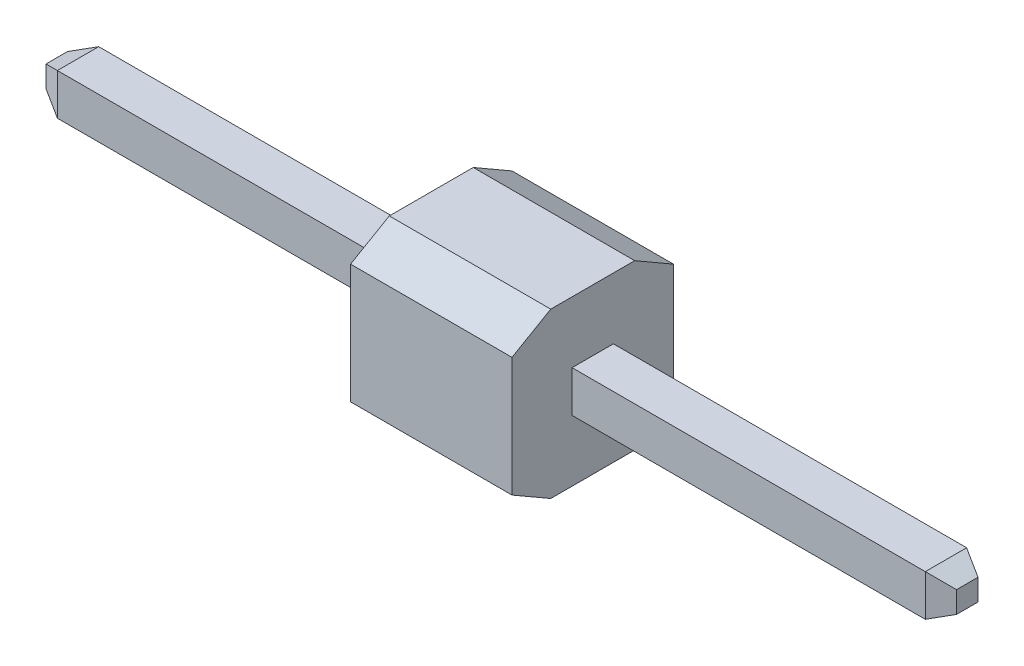
ISO-10303-21;
HEADER;
FILE_DESCRIPTION(('STEP AP214'),'2;1');
FILE_NAME('part.step','',(''),(''),'','','');
FILE_SCHEMA(('AUTOMOTIVE_DESIGN { 1 0 10303 214 1 1 1 1 }'));
ENDSEC;
DATA;
#1=APPLICATION_CONTEXT('core data for automotive mechanical design processes');
#2=APPLICATION_PROTOCOL_DEFINITION('international standard','automotive_design',2000,#1);
#3=PRODUCT_CONTEXT('',#1,'mechanical');
#4=PRODUCT('Part','Part','',(#3));
#5=PRODUCT_RELATED_PRODUCT_CATEGORY('part','',(#4));
#6=PRODUCT_DEFINITION_FORMATION('','',#4);
#7=PRODUCT_DEFINITION_CONTEXT('part definition',#1,'design');
#8=PRODUCT_DEFINITION('design','',#6,#7);
#9=PRODUCT_DEFINITION_SHAPE('','',#8);
#10=(LENGTH_UNIT() NAMED_UNIT(*) SI_UNIT(.MILLI.,.METRE.));
#11=(NAMED_UNIT(*) PLANE_ANGLE_UNIT() SI_UNIT($,.RADIAN.));
#12=(NAMED_UNIT(*) SI_UNIT($,.STERADIAN.) SOLID_ANGLE_UNIT());
#13=UNCERTAINTY_MEASURE_WITH_UNIT(LENGTH_MEASURE(1.E-05),#10,'distance_accuracy_value','');
#14=(GEOMETRIC_REPRESENTATION_CONTEXT(3) GLOBAL_UNCERTAINTY_ASSIGNED_CONTEXT((#13)) GLOBAL_UNIT_ASSIGNED_CONTEXT((#10,
#11,#12)) REPRESENTATION_CONTEXT('',''));
#15=CARTESIAN_POINT('',(0.,0.,0.));
#16=DIRECTION('',(0.,0.,1.));
#17=DIRECTION('',(1.,0.,0.));
#18=AXIS2_PLACEMENT_3D('',#15,#16,#17);
#19=CARTESIAN_POINT('',(5.42107527862679,-7.9371215871937,0.629998634255617));
#20=DIRECTION('',(1.,4.37113882867379E-08,-4.37113882867379E-08));
#21=DIRECTION('',(-4.37113882867379E-08,1.,0.));
#22=AXIS2_PLACEMENT_3D('',#19,#20,#21);
#23=PLANE('',#22);
#24=DIRECTION('',(1.59994777304463E-08,0.50000000000019,0.866025403784329));
#25=VECTOR('',#24,1.);
#26=CARTESIAN_POINT('',(5.42107515564087,-6.6935317487037,-0.940001365744382));
#27=LINE('',#26,#25);
#28=CARTESIAN_POINT('',(5.42107515564087,-6.6935317487037,-0.940001365744382));
#29=VERTEX_POINT('',#28);
#30=CARTESIAN_POINT('',(5.42107516672563,-6.3471215871937,-0.340001365744383));
#31=VERTEX_POINT('',#30);
#32=EDGE_CURVE('E11',#29,#31,#27,.T.);
#33=ORIENTED_EDGE('',*,*,#32,.T.);
#34=DIRECTION('',(4.37113886966664E-08,0.,0.999999999999999));
#35=VECTOR('',#34,1.);
#36=CARTESIAN_POINT('',(5.42107516672563,-6.3471215871937,-0.340001365744383));
#37=LINE('',#36,#35);
#38=CARTESIAN_POINT('',(5.42107522355044,-6.3471215871937,0.959998634255618));
#39=VERTEX_POINT('',#38);
#40=EDGE_CURVE('E304',#31,#39,#37,.T.);
#41=ORIENTED_EDGE('',*,*,#40,.T.);
#42=DIRECTION('',(5.97108668825761E-08,-0.500000000000186,0.86602540378433));
#43=VECTOR('',#42,1.);
#44=CARTESIAN_POINT('',(5.42107522355044,-6.3471215871937,0.959998634255618));
#45=LINE('',#44,#43);
#46=CARTESIAN_POINT('',(5.42107526491934,-6.69353174870369,1.55999863425562));
#47=VERTEX_POINT('',#46);
#48=EDGE_CURVE('E296',#39,#47,#45,.T.);
#49=ORIENTED_EDGE('',*,*,#48,.T.);
#50=DIRECTION('',(4.37113884815544E-08,-0.999999999999999,0.));
#51=VECTOR('',#50,1.);
#52=CARTESIAN_POINT('',(5.42107526491934,-6.69353174870369,1.55999863425562));
#53=LINE('',#52,#51);
#54=CARTESIAN_POINT('',(5.42107534566213,-8.5407114256737,1.55999863425562));
#55=VERTEX_POINT('',#54);
#56=EDGE_CURVE('E281',#47,#55,#53,.T.);
#57=ORIENTED_EDGE('',*,*,#56,.T.);
#58=DIRECTION('',(1.5999479012306E-08,0.500000000000192,0.866025403784328));
#59=VECTOR('',#58,1.);
#60=CARTESIAN_POINT('',(5.42107533457736,-8.8871215871937,0.959998634255618));
#61=LINE('',#60,#59);
#62=CARTESIAN_POINT('',(5.42107533457736,-8.8871215871937,0.959998634255618));
#63=VERTEX_POINT('',#62);
#64=EDGE_CURVE('E265',#63,#55,#61,.T.);
#65=ORIENTED_EDGE('',*,*,#64,.F.);
#66=DIRECTION('',(4.37113886966664E-08,0.,0.999999999999999));
#67=VECTOR('',#66,1.);
#68=CARTESIAN_POINT('',(5.42107527775256,-8.8871215871937,-0.340001365744383));
#69=LINE('',#68,#67);
#70=CARTESIAN_POINT('',(5.42107527775256,-8.8871215871937,-0.340001365744383));
#71=VERTEX_POINT('',#70);
#72=EDGE_CURVE('E248',#71,#63,#69,.T.);
#73=ORIENTED_EDGE('',*,*,#72,.F.);
#74=DIRECTION('',(5.97108656001701E-08,-0.500000000000187,0.866025403784328));
#75=VECTOR('',#74,1.);
#76=CARTESIAN_POINT('',(5.42107523638366,-8.5407114256737,-0.940001365744382));
#77=LINE('',#76,#75);
#78=CARTESIAN_POINT('',(5.42107523638366,-8.5407114256737,-0.940001365744382));
#79=VERTEX_POINT('',#78);
#80=EDGE_CURVE('E242',#79,#71,#77,.T.);
#81=ORIENTED_EDGE('',*,*,#80,.F.);
#82=DIRECTION('',(4.37113884815544E-08,-0.999999999999999,0.));
#83=VECTOR('',#82,1.);
#84=CARTESIAN_POINT('',(5.42107515564087,-6.6935317487037,-0.940001365744382));
#85=LINE('',#84,#83);
#86=EDGE_CURVE('E236',#29,#79,#85,.T.);
#87=ORIENTED_EDGE('',*,*,#86,.F.);
#88=EDGE_LOOP('',(#33,#41,#49,#57,#65,#73,#81,#87));
#89=FACE_BOUND('',#88,.T.);
#90=DIRECTION('',(-4.37113872875372E-08,0.,-0.999999999999999));
#91=VECTOR('',#90,1.);
#92=CARTESIAN_POINT('',(5.4210752506515,-7.2971215871937,0.629998634255617));
#93=LINE('',#92,#91);
#94=CARTESIAN_POINT('',(5.4210752506515,-7.2971215871937,0.629998634255617));
#95=VERTEX_POINT('',#94);
#96=CARTESIAN_POINT('',(5.42107522267621,-7.2971215871937,-0.0100013657443826));
#97=VERTEX_POINT('',#96);
#98=EDGE_CURVE('E302',#95,#97,#93,.T.);
#99=ORIENTED_EDGE('',*,*,#98,.T.);
#100=DIRECTION('',(-4.37113872875371E-08,0.999999999999999,0.));
#101=VECTOR('',#100,1.);
#102=CARTESIAN_POINT('',(5.4210752506515,-7.9371215871937,-0.0100013657443826));
#103=LINE('',#102,#101);
#104=CARTESIAN_POINT('',(5.4210752506515,-7.9371215871937,-0.0100013657443826));
#105=VERTEX_POINT('',#104);
#106=EDGE_CURVE('E293',#105,#97,#103,.T.);
#107=ORIENTED_EDGE('',*,*,#106,.F.);
#108=DIRECTION('',(-4.37113900630947E-08,0.,-0.999999999999999));
#109=VECTOR('',#108,1.);
#110=CARTESIAN_POINT('',(5.42107527862679,-7.9371215871937,0.629998634255617));
#111=LINE('',#110,#109);
#112=CARTESIAN_POINT('',(5.42107527862679,-7.9371215871937,0.629998634255617));
#113=VERTEX_POINT('',#112);
#114=EDGE_CURVE('E278',#113,#105,#111,.T.);
#115=ORIENTED_EDGE('',*,*,#114,.F.);
#116=DIRECTION('',(-4.37113900630947E-08,0.999999999999999,0.));
#117=VECTOR('',#116,1.);
#118=CARTESIAN_POINT('',(5.42107527862679,-7.9371215871937,0.629998634255617));
#119=LINE('',#118,#117);
#120=EDGE_CURVE('E263',#113,#95,#119,.T.);
#121=ORIENTED_EDGE('',*,*,#120,.T.);
#122=EDGE_LOOP('',(#99,#107,#115,#121));
#123=FACE_BOUND('',#122,.T.);
#124=ADVANCED_FACE('F17',(#89,#123),#23,.T.);
#125=CARTESIAN_POINT('',(2.92107527862679,-7.93712169647217,0.629998743534088));
#126=DIRECTION('',(1.,4.37113882867379E-08,-4.37113882867379E-08));
#127=DIRECTION('',(-4.37113882867379E-08,1.,0.));
#128=AXIS2_PLACEMENT_3D('',#125,#126,#127);
#129=PLANE('',#128);
#130=DIRECTION('',(1.59994783714339E-08,0.50000000000019,0.866025403784329));
#131=VECTOR('',#130,1.);
#132=CARTESIAN_POINT('',(2.92107515564087,-6.69353185798217,-0.940001256465912));
#133=LINE('',#132,#131);
#134=CARTESIAN_POINT('',(2.92107515564087,-6.69353185798217,-0.940001256465912));
#135=VERTEX_POINT('',#134);
#136=CARTESIAN_POINT('',(2.92107516672563,-6.34712169647217,-0.340001256465912));
#137=VERTEX_POINT('',#136);
#138=EDGE_CURVE('E24',#135,#137,#133,.T.);
#139=ORIENTED_EDGE('',*,*,#138,.F.);
#140=DIRECTION('',(4.37113882411396E-08,-0.999999999999999,0.));
#141=VECTOR('',#140,1.);
#142=CARTESIAN_POINT('',(2.92107515564087,-6.69353185798217,-0.940001256465912));
#143=LINE('',#142,#141);
#144=CARTESIAN_POINT('',(2.92107523638366,-8.54071153495217,-0.940001256465912));
#145=VERTEX_POINT('',#144);
#146=EDGE_CURVE('E300',#135,#145,#143,.T.);
#147=ORIENTED_EDGE('',*,*,#146,.T.);
#148=DIRECTION('',(5.97108668821452E-08,-0.500000000000187,0.866025403784328));
#149=VECTOR('',#148,1.);
#150=CARTESIAN_POINT('',(2.92107523638366,-8.54071153495217,-0.940001256465912));
#151=LINE('',#150,#149);
#152=CARTESIAN_POINT('',(2.92107527775256,-8.88712169647217,-0.340001256465912));
#153=VERTEX_POINT('',#152);
#154=EDGE_CURVE('E286',#145,#153,#151,.T.);
#155=ORIENTED_EDGE('',*,*,#154,.T.);
#156=DIRECTION('',(4.37113883550593E-08,0.,0.999999999999999));
#157=VECTOR('',#156,1.);
#158=CARTESIAN_POINT('',(2.92107527775256,-8.88712169647217,-0.340001256465912));
#159=LINE('',#158,#157);
#160=CARTESIAN_POINT('',(2.92107533457736,-8.88712169647217,0.959998743534088));
#161=VERTEX_POINT('',#160);
#162=EDGE_CURVE('E271',#153,#161,#159,.T.);
#163=ORIENTED_EDGE('',*,*,#162,.T.);
#164=DIRECTION('',(1.59994783713184E-08,0.500000000000192,0.866025403784328));
#165=VECTOR('',#164,1.);
#166=CARTESIAN_POINT('',(2.92107533457736,-8.88712169647217,0.959998743534088));
#167=LINE('',#166,#165);
#168=CARTESIAN_POINT('',(2.92107534566213,-8.54071153495217,1.55999874353409));
#169=VERTEX_POINT('',#168);
#170=EDGE_CURVE('E253',#161,#169,#167,.T.);
#171=ORIENTED_EDGE('',*,*,#170,.T.);
#172=DIRECTION('',(4.37113882411396E-08,-0.999999999999999,0.));
#173=VECTOR('',#172,1.);
#174=CARTESIAN_POINT('',(2.92107526491934,-6.69353185798217,1.55999874353409));
#175=LINE('',#174,#173);
#176=CARTESIAN_POINT('',(2.92107526491934,-6.69353185798217,1.55999874353409));
#177=VERTEX_POINT('',#176);
#178=EDGE_CURVE('E261',#177,#169,#175,.T.);
#179=ORIENTED_EDGE('',*,*,#178,.F.);
#180=DIRECTION('',(5.97108668825761E-08,-0.500000000000186,0.86602540378433));
#181=VECTOR('',#180,1.);
#182=CARTESIAN_POINT('',(2.92107522355044,-6.34712169647217,0.959998743534088));
#183=LINE('',#182,#181);
#184=CARTESIAN_POINT('',(2.92107522355044,-6.34712169647217,0.959998743534088));
#185=VERTEX_POINT('',#184);
#186=EDGE_CURVE('E276',#185,#177,#183,.T.);
#187=ORIENTED_EDGE('',*,*,#186,.F.);
#188=DIRECTION('',(4.37113883550593E-08,0.,0.999999999999999));
#189=VECTOR('',#188,1.);
#190=CARTESIAN_POINT('',(2.92107516672563,-6.34712169647217,-0.340001256465912));
#191=LINE('',#190,#189);
#192=EDGE_CURVE('E291',#137,#185,#191,.T.);
#193=ORIENTED_EDGE('',*,*,#192,.F.);
#194=EDGE_LOOP('',(#139,#147,#155,#163,#171,#179,#187,#193));
#195=FACE_BOUND('',#194,.T.);
#196=DIRECTION('',(-4.37113879814265E-08,0.999999999999999,0.));
#197=VECTOR('',#196,1.);
#198=CARTESIAN_POINT('',(2.9210752506515,-7.93712169647217,-0.0100012564659119));
#199=LINE('',#198,#197);
#200=CARTESIAN_POINT('',(2.9210752506515,-7.93712169647217,-0.0100012564659119));
#201=VERTEX_POINT('',#200);
#202=CARTESIAN_POINT('',(2.92107522267621,-7.29712169647217,-0.0100012564659119));
#203=VERTEX_POINT('',#202);
#204=EDGE_CURVE('E298',#201,#203,#199,.T.);
#205=ORIENTED_EDGE('',*,*,#204,.T.);
#206=DIRECTION('',(-4.37113879814266E-08,0.,-0.999999999999999));
#207=VECTOR('',#206,1.);
#208=CARTESIAN_POINT('',(2.9210752506515,-7.29712169647217,0.629998743534088));
#209=LINE('',#208,#207);
#210=CARTESIAN_POINT('',(2.9210752506515,-7.29712169647217,0.629998743534088));
#211=VERTEX_POINT('',#210);
#212=EDGE_CURVE('E283',#211,#203,#209,.T.);
#213=ORIENTED_EDGE('',*,*,#212,.F.);
#214=DIRECTION('',(-4.37113886753159E-08,0.999999999999999,0.));
#215=VECTOR('',#214,1.);
#216=CARTESIAN_POINT('',(2.92107527862679,-7.93712169647217,0.629998743534088));
#217=LINE('',#216,#215);
#218=CARTESIAN_POINT('',(2.92107527862679,-7.93712169647217,0.629998743534088));
#219=VERTEX_POINT('',#218);
#220=EDGE_CURVE('E268',#219,#211,#217,.T.);
#221=ORIENTED_EDGE('',*,*,#220,.F.);
#222=DIRECTION('',(-4.37113886753159E-08,0.,-0.999999999999999));
#223=VECTOR('',#222,1.);
#224=CARTESIAN_POINT('',(2.92107527862679,-7.93712169647217,0.629998743534088));
#225=LINE('',#224,#223);
#226=EDGE_CURVE('E251',#219,#201,#225,.T.);
#227=ORIENTED_EDGE('',*,*,#226,.T.);
#228=EDGE_LOOP('',(#205,#213,#221,#227));
#229=FACE_BOUND('',#228,.T.);
#230=ADVANCED_FACE('F314',(#195,#229),#129,.F.);
#231=CARTESIAN_POINT('',(5.42107515564087,-6.6935317487037,-0.940001365744382));
#232=DIRECTION('',(5.97108668343731E-08,-0.866025403784328,0.50000000000019));
#233=DIRECTION('',(-1.59994785476185E-08,-0.500000000000192,-0.866025403784329));
#234=AXIS2_PLACEMENT_3D('',#231,#232,#233);
#235=PLANE('',#234);
#236=ORIENTED_EDGE('',*,*,#138,.T.);
#237=DIRECTION('',(-0.999999999999998,-4.37113897078233E-08,4.37113883755557E-08));
#238=VECTOR('',#237,1.);
#239=CARTESIAN_POINT('',(5.42107516672563,-6.3471215871937,-0.340001365744383));
#240=LINE('',#239,#238);
#241=EDGE_CURVE('E288',#31,#137,#240,.T.);
#242=ORIENTED_EDGE('',*,*,#241,.F.);
#243=ORIENTED_EDGE('',*,*,#32,.F.);
#244=DIRECTION('',(-0.999999999999998,-4.37113868656524E-08,4.37113881091022E-08));
#245=VECTOR('',#244,1.);
#246=CARTESIAN_POINT('',(5.42107515564087,-6.6935317487037,-0.940001365744382));
#247=LINE('',#246,#245);
#248=EDGE_CURVE('E256',#29,#135,#247,.T.);
#249=ORIENTED_EDGE('',*,*,#248,.T.);
#250=EDGE_LOOP('',(#236,#242,#243,#249));
#251=FACE_BOUND('',#250,.T.);
#252=ADVANCED_FACE('F306',(#251),#235,.F.);
#253=CARTESIAN_POINT('',(5.42107516672563,-6.3471215871937,-0.340001365744383));
#254=DIRECTION('',(4.37113882867379E-08,-1.,0.));
#255=DIRECTION('',(1.,4.37113882867379E-08,-4.37113882867379E-08));
#256=AXIS2_PLACEMENT_3D('',#253,#254,#255);
#257=PLANE('',#256);
#258=ORIENTED_EDGE('',*,*,#192,.T.);
#259=DIRECTION('',(-0.999999999999998,-4.37113897078233E-08,4.37113882867378E-08));
#260=VECTOR('',#259,1.);
#261=CARTESIAN_POINT('',(5.42107522355044,-6.3471215871937,0.959998634255618));
#262=LINE('',#261,#260);
#263=EDGE_CURVE('E273',#39,#185,#262,.T.);
#264=ORIENTED_EDGE('',*,*,#263,.F.);
#265=ORIENTED_EDGE('',*,*,#40,.F.);
#266=ORIENTED_EDGE('',*,*,#241,.T.);
#267=EDGE_LOOP('',(#258,#264,#265,#266));
#268=FACE_BOUND('',#267,.T.);
#269=ADVANCED_FACE('F311',(#268),#257,.F.);
#270=CARTESIAN_POINT('',(5.42107522355044,-6.3471215871937,0.959998634255618));
#271=DIRECTION('',(1.59994785476185E-08,-0.86602540378433,-0.50000000000019));
#272=DIRECTION('',(-5.97108668343731E-08,0.500000000000188,-0.866025403784329));
#273=AXIS2_PLACEMENT_3D('',#270,#271,#272);
#274=PLANE('',#273);
#275=ORIENTED_EDGE('',*,*,#186,.T.);
#276=DIRECTION('',(-0.999999999999998,-4.37113868656524E-08,4.37113882867378E-08));
#277=VECTOR('',#276,1.);
#278=CARTESIAN_POINT('',(5.42107526491934,-6.69353174870369,1.55999863425562));
#279=LINE('',#278,#277);
#280=EDGE_CURVE('E258',#47,#177,#279,.T.);
#281=ORIENTED_EDGE('',*,*,#280,.F.);
#282=ORIENTED_EDGE('',*,*,#48,.F.);
#283=ORIENTED_EDGE('',*,*,#263,.T.);
#284=EDGE_LOOP('',(#275,#281,#282,#283));
#285=FACE_BOUND('',#284,.T.);
#286=ADVANCED_FACE('F319',(#285),#274,.F.);
#287=CARTESIAN_POINT('',(5.42107526491934,-6.69353174870369,1.55999863425562));
#288=DIRECTION('',(-4.37113882867379E-08,0.,-1.));
#289=DIRECTION('',(-1.,-4.37113882867379E-08,4.37113882867379E-08));
#290=AXIS2_PLACEMENT_3D('',#287,#288,#289);
#291=PLANE('',#290);
#292=ORIENTED_EDGE('',*,*,#178,.T.);
#293=DIRECTION('',(-0.999999999999998,-4.37113868656524E-08,4.37113882867378E-08));
#294=VECTOR('',#293,1.);
#295=CARTESIAN_POINT('',(5.42107534566213,-8.5407114256737,1.55999863425562));
#296=LINE('',#295,#294);
#297=EDGE_CURVE('E245',#55,#169,#296,.T.);
#298=ORIENTED_EDGE('',*,*,#297,.F.);
#299=ORIENTED_EDGE('',*,*,#56,.F.);
#300=ORIENTED_EDGE('',*,*,#280,.T.);
#301=EDGE_LOOP('',(#292,#298,#299,#300));
#302=FACE_BOUND('',#301,.T.);
#303=ADVANCED_FACE('F326',(#302),#291,.F.);
#304=CARTESIAN_POINT('',(5.42107533457736,-8.8871215871937,0.959998634255618));
#305=DIRECTION('',(5.97108668343731E-08,-0.866025403784328,0.50000000000019));
#306=DIRECTION('',(-1.59994785476185E-08,-0.500000000000192,-0.866025403784329));
#307=AXIS2_PLACEMENT_3D('',#304,#305,#306);
#308=PLANE('',#307);
#309=ORIENTED_EDGE('',*,*,#170,.F.);
#310=DIRECTION('',(-0.999999999999998,-4.37113868656524E-08,4.37113882867378E-08));
#311=VECTOR('',#310,1.);
#312=CARTESIAN_POINT('',(5.42107533457736,-8.8871215871937,0.959998634255618));
#313=LINE('',#312,#311);
#314=EDGE_CURVE('E239',#63,#161,#313,.T.);
#315=ORIENTED_EDGE('',*,*,#314,.F.);
#316=ORIENTED_EDGE('',*,*,#64,.T.);
#317=ORIENTED_EDGE('',*,*,#297,.T.);
#318=EDGE_LOOP('',(#309,#315,#316,#317));
#319=FACE_BOUND('',#318,.T.);
#320=ADVANCED_FACE('F329',(#319),#308,.T.);
#321=CARTESIAN_POINT('',(5.42107527775256,-8.8871215871937,-0.340001365744383));
#322=DIRECTION('',(4.37113882867379E-08,-1.,0.));
#323=DIRECTION('',(1.,4.37113882867379E-08,-4.37113882867379E-08));
#324=AXIS2_PLACEMENT_3D('',#321,#322,#323);
#325=PLANE('',#324);
#326=ORIENTED_EDGE('',*,*,#162,.F.);
#327=DIRECTION('',(-0.999999999999998,-4.37113868656524E-08,4.37113883755557E-08));
#328=VECTOR('',#327,1.);
#329=CARTESIAN_POINT('',(5.42107527775256,-8.8871215871937,-0.340001365744383));
#330=LINE('',#329,#328);
#331=EDGE_CURVE('E233',#71,#153,#330,.T.);
#332=ORIENTED_EDGE('',*,*,#331,.F.);
#333=ORIENTED_EDGE('',*,*,#72,.T.);
#334=ORIENTED_EDGE('',*,*,#314,.T.);
#335=EDGE_LOOP('',(#326,#332,#333,#334));
#336=FACE_BOUND('',#335,.T.);
#337=ADVANCED_FACE('F333',(#336),#325,.T.);
#338=CARTESIAN_POINT('',(5.42107523638366,-8.5407114256737,-0.940001365744382));
#339=DIRECTION('',(1.59994785476185E-08,-0.86602540378433,-0.50000000000019));
#340=DIRECTION('',(-5.97108668343731E-08,0.500000000000188,-0.866025403784329));
#341=AXIS2_PLACEMENT_3D('',#338,#339,#340);
#342=PLANE('',#341);
#343=ORIENTED_EDGE('',*,*,#154,.F.);
#344=DIRECTION('',(-0.999999999999998,-4.37113868656524E-08,4.37113881091021E-08));
#345=VECTOR('',#344,1.);
#346=CARTESIAN_POINT('',(5.42107523638366,-8.5407114256737,-0.940001365744382));
#347=LINE('',#346,#345);
#348=EDGE_CURVE('E230',#79,#145,#347,.T.);
#349=ORIENTED_EDGE('',*,*,#348,.F.);
#350=ORIENTED_EDGE('',*,*,#80,.T.);
#351=ORIENTED_EDGE('',*,*,#331,.T.);
#352=EDGE_LOOP('',(#343,#349,#350,#351));
#353=FACE_BOUND('',#352,.T.);
#354=ADVANCED_FACE('F337',(#353),#342,.T.);
#355=CARTESIAN_POINT('',(5.42107515564087,-6.6935317487037,-0.940001365744382));
#356=DIRECTION('',(-4.37113882867379E-08,0.,-1.));
#357=DIRECTION('',(-4.37113882867379E-08,1.,0.));
#358=AXIS2_PLACEMENT_3D('',#355,#356,#357);
#359=PLANE('',#358);
#360=ORIENTED_EDGE('',*,*,#146,.F.);
#361=ORIENTED_EDGE('',*,*,#248,.F.);
#362=ORIENTED_EDGE('',*,*,#86,.T.);
#363=ORIENTED_EDGE('',*,*,#348,.T.);
#364=EDGE_LOOP('',(#360,#361,#362,#363));
#365=FACE_BOUND('',#364,.T.);
#366=ADVANCED_FACE('F339',(#365),#359,.T.);
#367=CARTESIAN_POINT('',(-2.87892472137321,-7.93712194999822,0.62999899706014));
#368=DIRECTION('',(-1.,-4.37113882867379E-08,4.37113882867379E-08));
#369=DIRECTION('',(4.37113882867379E-08,-1.,0.));
#370=AXIS2_PLACEMENT_3D('',#367,#368,#369);
#371=PLANE('',#370);
#372=DIRECTION('',(4.37113927490808E-08,-0.999999999999999,0.));
#373=VECTOR('',#372,1.);
#374=CARTESIAN_POINT('',(-2.87892476387104,-7.45100347718822,0.14388052425114));
#375=LINE('',#374,#373);
#376=CARTESIAN_POINT('',(-2.87892476387104,-7.45100347718822,0.14388052425114));
#377=VERTEX_POINT('',#376);
#378=CARTESIAN_POINT('',(-2.8789247493485,-7.78324042279822,0.14388052425114));
#379=VERTEX_POINT('',#378);
#380=EDGE_CURVE('E228',#377,#379,#375,.T.);
#381=ORIENTED_EDGE('',*,*,#380,.T.);
#382=DIRECTION('',(4.37113874013716E-08,0.,0.999999999999999));
#383=VECTOR('',#382,1.);
#384=CARTESIAN_POINT('',(-2.8789247493485,-7.78324042279822,0.14388052425114));
#385=LINE('',#384,#383);
#386=CARTESIAN_POINT('',(-2.87892473482596,-7.78324042279822,0.47611746986914));
#387=VERTEX_POINT('',#386);
#388=EDGE_CURVE('E223',#379,#387,#385,.T.);
#389=ORIENTED_EDGE('',*,*,#388,.T.);
#390=DIRECTION('',(-4.37113900757526E-08,0.999999999999999,0.));
#391=VECTOR('',#390,1.);
#392=CARTESIAN_POINT('',(-2.87892473482596,-7.78324042279822,0.47611746986914));
#393=LINE('',#392,#391);
#394=CARTESIAN_POINT('',(-2.8789247493485,-7.45100347718822,0.47611746986914));
#395=VERTEX_POINT('',#394);
#396=EDGE_CURVE('E215',#387,#395,#393,.T.);
#397=ORIENTED_EDGE('',*,*,#396,.T.);
#398=DIRECTION('',(-4.37113847280434E-08,0.,-0.999999999999999));
#399=VECTOR('',#398,1.);
#400=CARTESIAN_POINT('',(-2.8789247493485,-7.45100347718822,0.47611746986914));
#401=LINE('',#400,#399);
#402=EDGE_CURVE('E207',#395,#377,#401,.T.);
#403=ORIENTED_EDGE('',*,*,#402,.T.);
#404=EDGE_LOOP('',(#381,#389,#397,#403));
#405=FACE_BOUND('',#404,.T.);
#406=ADVANCED_FACE('F341',(#405),#371,.T.);
#407=CARTESIAN_POINT('',(-2.87892472137321,-7.93712194999822,0.62999899706014));
#408=DIRECTION('',(4.37113882867379E-08,-1.,0.));
#409=DIRECTION('',(-4.37113882867379E-08,0.,-1.));
#410=AXIS2_PLACEMENT_3D('',#407,#408,#409);
#411=PLANE('',#410);
#412=DIRECTION('',(0.999999999999998,4.37113894947904E-08,-4.37113882769955E-08));
#413=VECTOR('',#412,1.);
#414=CARTESIAN_POINT('',(-2.54892472137321,-7.93712193557346,0.629998982635382));
#415=LINE('',#414,#413);
#416=CARTESIAN_POINT('',(-2.54892472137321,-7.93712193557346,0.629998982635382));
#417=VERTEX_POINT('',#416);
#418=EDGE_CURVE('E225',#417,#219,#415,.T.);
#419=ORIENTED_EDGE('',*,*,#418,.F.);
#420=DIRECTION('',(-4.37113872875372E-08,0.,-0.999999999999999));
#421=VECTOR('',#420,1.);
#422=CARTESIAN_POINT('',(-2.54892472137321,-7.93712193557346,0.629998982635382));
#423=LINE('',#422,#421);
#424=CARTESIAN_POINT('',(-2.5489247493485,-7.93712193557346,-0.010001017364618));
#425=VERTEX_POINT('',#424);
#426=EDGE_CURVE('E217',#417,#425,#423,.T.);
#427=ORIENTED_EDGE('',*,*,#426,.T.);
#428=DIRECTION('',(0.999999999999998,4.37113894947904E-08,-4.37113882161058E-08));
#429=VECTOR('',#428,1.);
#430=CARTESIAN_POINT('',(-2.5489247493485,-7.93712193557346,-0.010001017364618));
#431=LINE('',#430,#429);
#432=EDGE_CURVE('E220',#425,#201,#431,.T.);
#433=ORIENTED_EDGE('',*,*,#432,.T.);
#434=ORIENTED_EDGE('',*,*,#226,.F.);
#435=EDGE_LOOP('',(#419,#427,#433,#434));
#436=FACE_BOUND('',#435,.T.);
#437=ADVANCED_FACE('F348',(#436),#411,.T.);
#438=CARTESIAN_POINT('',(-2.8789247493485,-7.93712194999822,-0.0100010029398598));
#439=DIRECTION('',(-4.37113882867379E-08,0.,-1.));
#440=DIRECTION('',(-1.,-4.37113882867379E-08,4.37113882867379E-08));
#441=AXIS2_PLACEMENT_3D('',#438,#439,#440);
#442=PLANE('',#441);
#443=ORIENTED_EDGE('',*,*,#432,.F.);
#444=DIRECTION('',(-4.37113886753159E-08,0.999999999999999,0.));
#445=VECTOR('',#444,1.);
#446=CARTESIAN_POINT('',(-2.5489247493485,-7.93712193557346,-0.010001017364618));
#447=LINE('',#446,#445);
#448=CARTESIAN_POINT('',(-2.54892477732379,-7.29712193557346,-0.010001017364618));
#449=VERTEX_POINT('',#448);
#450=EDGE_CURVE('E209',#425,#449,#447,.T.);
#451=ORIENTED_EDGE('',*,*,#450,.T.);
#452=DIRECTION('',(0.999999999999998,4.37113894947904E-08,-4.37113882161057E-08));
#453=VECTOR('',#452,1.);
#454=CARTESIAN_POINT('',(-2.54892477732379,-7.29712193557346,-0.010001017364618));
#455=LINE('',#454,#453);
#456=EDGE_CURVE('E212',#449,#203,#455,.T.);
#457=ORIENTED_EDGE('',*,*,#456,.T.);
#458=ORIENTED_EDGE('',*,*,#204,.F.);
#459=EDGE_LOOP('',(#443,#451,#457,#458));
#460=FACE_BOUND('',#459,.T.);
#461=ADVANCED_FACE('F424',(#460),#442,.T.);
#462=CARTESIAN_POINT('',(-2.8789247493485,-7.29712194999822,0.62999899706014));
#463=DIRECTION('',(4.37113882867379E-08,-1.,0.));
#464=DIRECTION('',(-4.37113882867379E-08,0.,-1.));
#465=AXIS2_PLACEMENT_3D('',#462,#463,#464);
#466=PLANE('',#465);
#467=ORIENTED_EDGE('',*,*,#456,.F.);
#468=DIRECTION('',(4.37113900630947E-08,0.,0.999999999999999));
#469=VECTOR('',#468,1.);
#470=CARTESIAN_POINT('',(-2.54892477732379,-7.29712193557347,-0.010001017364618));
#471=LINE('',#470,#469);
#472=CARTESIAN_POINT('',(-2.5489247493485,-7.29712193557346,0.629998982635382));
#473=VERTEX_POINT('',#472);
#474=EDGE_CURVE('E201',#449,#473,#471,.T.);
#475=ORIENTED_EDGE('',*,*,#474,.T.);
#476=DIRECTION('',(0.999999999999998,4.37113894947904E-08,-4.37113882769955E-08));
#477=VECTOR('',#476,1.);
#478=CARTESIAN_POINT('',(-2.5489247493485,-7.29712193557346,0.629998982635382));
#479=LINE('',#478,#477);
#480=EDGE_CURVE('E204',#473,#211,#479,.T.);
#481=ORIENTED_EDGE('',*,*,#480,.T.);
#482=ORIENTED_EDGE('',*,*,#212,.T.);
#483=EDGE_LOOP('',(#467,#475,#481,#482));
#484=FACE_BOUND('',#483,.T.);
#485=ADVANCED_FACE('F421',(#484),#466,.F.);
#486=CARTESIAN_POINT('',(-2.87892472137321,-7.93712194999822,0.62999899706014));
#487=DIRECTION('',(-4.37113882867379E-08,0.,-1.));
#488=DIRECTION('',(-1.,-4.37113882867379E-08,4.37113882867379E-08));
#489=AXIS2_PLACEMENT_3D('',#486,#487,#488);
#490=PLANE('',#489);
#491=ORIENTED_EDGE('',*,*,#480,.F.);
#492=DIRECTION('',(4.37113858997583E-08,-0.999999999999999,0.));
#493=VECTOR('',#492,1.);
#494=CARTESIAN_POINT('',(-2.5489247493485,-7.29712193557346,0.629998982635382));
#495=LINE('',#494,#493);
#496=EDGE_CURVE('E196',#473,#417,#495,.T.);
#497=ORIENTED_EDGE('',*,*,#496,.T.);
#498=ORIENTED_EDGE('',*,*,#418,.T.);
#499=ORIENTED_EDGE('',*,*,#220,.T.);
#500=EDGE_LOOP('',(#491,#497,#498,#499));
#501=FACE_BOUND('',#500,.T.);
#502=ADVANCED_FACE('F376',(#501),#490,.F.);
#503=CARTESIAN_POINT('',(-2.87892472137321,-7.93712194999822,0.62999899706014));
#504=DIRECTION('',(-4.37113882867379E-08,0.,-1.));
#505=DIRECTION('',(-1.,-4.37113882867379E-08,4.37113882867379E-08));
#506=AXIS2_PLACEMENT_3D('',#503,#504,#505);
#507=PLANE('',#506);
#508=DIRECTION('',(0.999999999999998,4.37113881958092E-08,-4.37113882769955E-08));
#509=VECTOR('',#508,1.);
#510=CARTESIAN_POINT('',(5.42107527862679,-7.93712158719369,0.629998634255617));
#511=LINE('',#510,#509);
#512=CARTESIAN_POINT('',(10.8910752786268,-7.9371213480924,0.629998395154324));
#513=VERTEX_POINT('',#512);
#514=EDGE_CURVE('E199',#113,#513,#511,.T.);
#515=ORIENTED_EDGE('',*,*,#514,.T.);
#516=DIRECTION('',(-4.37113900630947E-08,0.999999999999999,0.));
#517=VECTOR('',#516,1.);
#518=CARTESIAN_POINT('',(10.8910752786268,-7.9371213480924,0.629998395154324));
#519=LINE('',#518,#517);
#520=CARTESIAN_POINT('',(10.8910752506515,-7.2971213480924,0.629998395154324));
#521=VERTEX_POINT('',#520);
#522=EDGE_CURVE('E191',#513,#521,#519,.T.);
#523=ORIENTED_EDGE('',*,*,#522,.T.);
#524=DIRECTION('',(0.999999999999998,4.37113829998842E-08,-4.37113882769955E-08));
#525=VECTOR('',#524,1.);
#526=CARTESIAN_POINT('',(5.4210752506515,-7.2971215871937,0.629998634255617));
#527=LINE('',#526,#525);
#528=EDGE_CURVE('E194',#95,#521,#527,.T.);
#529=ORIENTED_EDGE('',*,*,#528,.F.);
#530=ORIENTED_EDGE('',*,*,#120,.F.);
#531=EDGE_LOOP('',(#515,#523,#529,#530));
#532=FACE_BOUND('',#531,.T.);
#533=ADVANCED_FACE('F367',(#532),#507,.F.);
#534=CARTESIAN_POINT('',(-2.8789247493485,-7.29712194999822,0.62999899706014));
#535=DIRECTION('',(4.37113882867379E-08,-1.,0.));
#536=DIRECTION('',(-4.37113882867379E-08,0.,-1.));
#537=AXIS2_PLACEMENT_3D('',#534,#535,#536);
#538=PLANE('',#537);
#539=ORIENTED_EDGE('',*,*,#528,.T.);
#540=DIRECTION('',(-4.37113900630947E-08,0.,-0.999999999999999));
#541=VECTOR('',#540,1.);
#542=CARTESIAN_POINT('',(10.8910752506515,-7.2971213480924,0.629998395154324));
#543=LINE('',#542,#541);
#544=CARTESIAN_POINT('',(10.8910752226762,-7.2971213480924,-0.0100016048456765));
#545=VERTEX_POINT('',#544);
#546=EDGE_CURVE('E186',#521,#545,#543,.T.);
#547=ORIENTED_EDGE('',*,*,#546,.T.);
#548=DIRECTION('',(0.999999999999998,4.37113829998842E-08,-4.37113881146228E-08));
#549=VECTOR('',#548,1.);
#550=CARTESIAN_POINT('',(5.42107522267621,-7.2971215871937,-0.0100013657443823));
#551=LINE('',#550,#549);
#552=EDGE_CURVE('E189',#97,#545,#551,.T.);
#553=ORIENTED_EDGE('',*,*,#552,.F.);
#554=ORIENTED_EDGE('',*,*,#98,.F.);
#555=EDGE_LOOP('',(#539,#547,#553,#554));
#556=FACE_BOUND('',#555,.T.);
#557=ADVANCED_FACE('F364',(#556),#538,.F.);
#558=CARTESIAN_POINT('',(-2.8789247493485,-7.93712194999822,-0.0100010029398598));
#559=DIRECTION('',(-4.37113882867379E-08,0.,-1.));
#560=DIRECTION('',(-1.,-4.37113882867379E-08,4.37113882867379E-08));
#561=AXIS2_PLACEMENT_3D('',#558,#559,#560);
#562=PLANE('',#561);
#563=ORIENTED_EDGE('',*,*,#552,.T.);
#564=DIRECTION('',(4.37113872875371E-08,-0.999999999999999,0.));
#565=VECTOR('',#564,1.);
#566=CARTESIAN_POINT('',(10.8910752226762,-7.2971213480924,-0.0100016048456764));
#567=LINE('',#566,#565);
#568=CARTESIAN_POINT('',(10.8910752506515,-7.9371213480924,-0.0100016048456765));
#569=VERTEX_POINT('',#568);
#570=EDGE_CURVE('E176',#545,#569,#567,.T.);
#571=ORIENTED_EDGE('',*,*,#570,.T.);
#572=DIRECTION('',(0.999999999999998,4.37113881958092E-08,-4.37113881146228E-08));
#573=VECTOR('',#572,1.);
#574=CARTESIAN_POINT('',(5.4210752506515,-7.93712158719369,-0.0100013657443823));
#575=LINE('',#574,#573);
#576=EDGE_CURVE('E179',#105,#569,#575,.T.);
#577=ORIENTED_EDGE('',*,*,#576,.F.);
#578=ORIENTED_EDGE('',*,*,#106,.T.);
#579=EDGE_LOOP('',(#563,#571,#577,#578));
#580=FACE_BOUND('',#579,.T.);
#581=ADVANCED_FACE('F366',(#580),#562,.T.);
#582=CARTESIAN_POINT('',(-2.87892472137321,-7.93712194999822,0.62999899706014));
#583=DIRECTION('',(4.37113882867379E-08,-1.,0.));
#584=DIRECTION('',(-4.37113882867379E-08,0.,-1.));
#585=AXIS2_PLACEMENT_3D('',#582,#583,#584);
#586=PLANE('',#585);
#587=ORIENTED_EDGE('',*,*,#576,.T.);
#588=DIRECTION('',(4.37113845119796E-08,0.,0.999999999999999));
#589=VECTOR('',#588,1.);
#590=CARTESIAN_POINT('',(10.8910752506515,-7.9371213480924,-0.0100016048456765));
#591=LINE('',#590,#589);
#592=EDGE_CURVE('E167',#569,#513,#591,.T.);
#593=ORIENTED_EDGE('',*,*,#592,.T.);
#594=ORIENTED_EDGE('',*,*,#514,.F.);
#595=ORIENTED_EDGE('',*,*,#114,.T.);
#596=EDGE_LOOP('',(#587,#593,#594,#595));
#597=FACE_BOUND('',#596,.T.);
#598=ADVANCED_FACE('F373',(#597),#586,.T.);
#599=CARTESIAN_POINT('',(11.2210752786268,-7.93712133366764,0.629998380729565));
#600=DIRECTION('',(-1.,-4.37113882867379E-08,4.37113882867379E-08));
#601=DIRECTION('',(4.37113882867379E-08,-1.,0.));
#602=AXIS2_PLACEMENT_3D('',#599,#600,#601);
#603=PLANE('',#602);
#604=DIRECTION('',(-4.37113874024243E-08,0.999999999999999,0.));
#605=VECTOR('',#604,1.);
#606=CARTESIAN_POINT('',(11.2210752506515,-7.78323980646765,0.143879907920565));
#607=LINE('',#606,#605);
#608=CARTESIAN_POINT('',(11.2210752506515,-7.78323980646765,0.143879907920565));
#609=VERTEX_POINT('',#608);
#610=CARTESIAN_POINT('',(11.221075236129,-7.45100286085765,0.143879907920565));
#611=VERTEX_POINT('',#610);
#612=EDGE_CURVE('E153',#609,#611,#607,.T.);
#613=ORIENTED_EDGE('',*,*,#612,.T.);
#614=DIRECTION('',(4.37113874013716E-08,0.,0.999999999999999));
#615=VECTOR('',#614,1.);
#616=CARTESIAN_POINT('',(11.221075236129,-7.45100286085765,0.143879907920565));
#617=LINE('',#616,#615);
#618=CARTESIAN_POINT('',(11.2210752506515,-7.45100286085765,0.476116853538565));
#619=VERTEX_POINT('',#618);
#620=EDGE_CURVE('E395',#611,#619,#617,.T.);
#621=ORIENTED_EDGE('',*,*,#620,.T.);
#622=DIRECTION('',(4.37113874024243E-08,-0.999999999999999,0.));
#623=VECTOR('',#622,1.);
#624=CARTESIAN_POINT('',(11.2210752506515,-7.45100286085765,0.476116853538565));
#625=LINE('',#624,#623);
#626=CARTESIAN_POINT('',(11.221075265174,-7.78323980646765,0.476116853538565));
#627=VERTEX_POINT('',#626);
#628=EDGE_CURVE('E156',#619,#627,#625,.T.);
#629=ORIENTED_EDGE('',*,*,#628,.T.);
#630=DIRECTION('',(-4.37113927480282E-08,0.,-0.999999999999999));
#631=VECTOR('',#630,1.);
#632=CARTESIAN_POINT('',(11.221075265174,-7.78323980646765,0.476116853538565));
#633=LINE('',#632,#631);
#634=EDGE_CURVE('E149',#627,#609,#633,.T.);
#635=ORIENTED_EDGE('',*,*,#634,.T.);
#636=EDGE_LOOP('',(#613,#621,#629,#635));
#637=FACE_BOUND('',#636,.T.);
#638=ADVANCED_FACE('F151',(#637),#603,.F.);
#639=CARTESIAN_POINT('',(-2.87892474262213,-7.45100347718822,0.62999899706014));
#640=DIRECTION('',(-0.422618301356784,0.906307768563367,1.84732310895534E-08));
#641=DIRECTION('',(4.37113882867379E-08,0.,1.));
#642=AXIS2_PLACEMENT_3D('',#639,#640,#641);
#643=PLANE('',#642);
#644=DIRECTION('',(0.834817095446925,0.38928165712602,-0.389281657126018));
#645=VECTOR('',#644,1.);
#646=CARTESIAN_POINT('',(-2.87892476387106,-7.4510034771877,0.143880524251623));
#647=LINE('',#646,#645);
#648=EDGE_CURVE('E181',#377,#449,#647,.T.);
#649=ORIENTED_EDGE('',*,*,#648,.F.);
#650=ORIENTED_EDGE('',*,*,#402,.F.);
#651=DIRECTION('',(-0.834817129479007,-0.389281657126019,-0.389281584143986));
#652=VECTOR('',#651,1.);
#653=CARTESIAN_POINT('',(-2.54892474934893,-7.297121935572,0.629998982634844));
#654=LINE('',#653,#652);
#655=EDGE_CURVE('E404',#473,#395,#654,.T.);
#656=ORIENTED_EDGE('',*,*,#655,.F.);
#657=ORIENTED_EDGE('',*,*,#474,.F.);
#658=EDGE_LOOP('',(#649,#650,#656,#657));
#659=FACE_BOUND('',#658,.T.);
#660=ADVANCED_FACE('F418',(#659),#643,.T.);
#661=CARTESIAN_POINT('',(-2.87892472809959,-7.93712194999822,0.47611746986914));
#662=DIRECTION('',(-0.422618222124841,-1.84732292043498E-08,0.906307805509828));
#663=DIRECTION('',(4.37113882867379E-08,-1.,0.));
#664=AXIS2_PLACEMENT_3D('',#661,#662,#663);
#665=PLANE('',#664);
#666=ORIENTED_EDGE('',*,*,#655,.T.);
#667=ORIENTED_EDGE('',*,*,#396,.F.);
#668=DIRECTION('',(-0.834817163511087,0.389281584143985,-0.389281584143987));
#669=VECTOR('',#668,1.);
#670=CARTESIAN_POINT('',(-2.54892472137207,-7.93712193557073,0.629998982635654));
#671=LINE('',#670,#669);
#672=EDGE_CURVE('E160',#417,#387,#671,.T.);
#673=ORIENTED_EDGE('',*,*,#672,.F.);
#674=ORIENTED_EDGE('',*,*,#496,.F.);
#675=EDGE_LOOP('',(#666,#667,#673,#674));
#676=FACE_BOUND('',#675,.T.);
#677=ADVANCED_FACE('F434',(#676),#665,.T.);
#678=CARTESIAN_POINT('',(-2.5489247493485,-7.93712193557346,-0.010001017364618));
#679=DIRECTION('',(0.422618301356784,1.8473232667688E-08,0.906307768563367));
#680=DIRECTION('',(-4.37113882867379E-08,1.,0.));
#681=AXIS2_PLACEMENT_3D('',#678,#679,#680);
#682=PLANE('',#681);
#683=ORIENTED_EDGE('',*,*,#648,.T.);
#684=ORIENTED_EDGE('',*,*,#450,.F.);
#685=DIRECTION('',(0.834817129479008,-0.389281584143985,-0.389281657126018));
#686=VECTOR('',#685,1.);
#687=CARTESIAN_POINT('',(-2.87892474935134,-7.78324042280576,0.1438805242526));
#688=LINE('',#687,#686);
#689=EDGE_CURVE('E170',#379,#425,#688,.T.);
#690=ORIENTED_EDGE('',*,*,#689,.F.);
#691=ORIENTED_EDGE('',*,*,#380,.F.);
#692=EDGE_LOOP('',(#683,#684,#690,#691));
#693=FACE_BOUND('',#692,.T.);
#694=ADVANCED_FACE('F413',(#693),#682,.F.);
#695=CARTESIAN_POINT('',(-2.54892472137321,-7.93712193557346,0.629998982635382));
#696=DIRECTION('',(0.422618222124841,0.906307805509828,-1.84732308250282E-08));
#697=DIRECTION('',(-4.37113882867379E-08,0.,-1.));
#698=AXIS2_PLACEMENT_3D('',#695,#696,#697);
#699=PLANE('',#698);
#700=ORIENTED_EDGE('',*,*,#672,.T.);
#701=ORIENTED_EDGE('',*,*,#388,.F.);
#702=ORIENTED_EDGE('',*,*,#689,.T.);
#703=ORIENTED_EDGE('',*,*,#426,.F.);
#704=EDGE_LOOP('',(#700,#701,#702,#703));
#705=FACE_BOUND('',#704,.T.);
#706=ADVANCED_FACE('F429',(#705),#699,.F.);
#707=CARTESIAN_POINT('',(11.2210752719004,-7.78323980646765,0.629998380729565));
#708=DIRECTION('',(0.422618301356784,-0.906307768563367,-1.84732310470096E-08));
#709=DIRECTION('',(4.37113882867379E-08,0.,1.));
#710=AXIS2_PLACEMENT_3D('',#707,#708,#709);
#711=PLANE('',#710);
#712=DIRECTION('',(-0.834817129479004,-0.389281657126025,-0.389281584143987));
#713=VECTOR('',#712,1.);
#714=CARTESIAN_POINT('',(11.2210752506515,-7.78323980646816,0.143879907921048));
#715=LINE('',#714,#713);
#716=EDGE_CURVE('E164',#609,#569,#715,.T.);
#717=ORIENTED_EDGE('',*,*,#716,.F.);
#718=ORIENTED_EDGE('',*,*,#634,.F.);
#719=DIRECTION('',(0.834817095446923,0.389281657126025,-0.389281657126018));
#720=VECTOR('',#719,1.);
#721=CARTESIAN_POINT('',(10.8910752786268,-7.9371213480924,0.629998395154324));
#722=LINE('',#721,#720);
#723=EDGE_CURVE('E392',#513,#627,#722,.T.);
#724=ORIENTED_EDGE('',*,*,#723,.F.);
#725=ORIENTED_EDGE('',*,*,#592,.F.);
#726=EDGE_LOOP('',(#717,#718,#724,#725));
#727=FACE_BOUND('',#726,.T.);
#728=ADVANCED_FACE('F165',(#727),#711,.T.);
#729=CARTESIAN_POINT('',(10.8910752786268,-7.9371213480924,0.629998395154324));
#730=DIRECTION('',(-0.422618301356784,-1.8473232667688E-08,-0.906307768563367));
#731=DIRECTION('',(-4.37113882867379E-08,1.,0.));
#732=AXIS2_PLACEMENT_3D('',#729,#730,#731);
#733=PLANE('',#732);
#734=ORIENTED_EDGE('',*,*,#723,.T.);
#735=ORIENTED_EDGE('',*,*,#628,.F.);
#736=DIRECTION('',(0.834817129479006,-0.389281584143989,-0.38928165712602));
#737=VECTOR('',#736,1.);
#738=CARTESIAN_POINT('',(10.891075250653,-7.29712134808819,0.629998395153421));
#739=LINE('',#738,#737);
#740=EDGE_CURVE('E389',#521,#619,#739,.T.);
#741=ORIENTED_EDGE('',*,*,#740,.F.);
#742=ORIENTED_EDGE('',*,*,#522,.F.);
#743=EDGE_LOOP('',(#734,#735,#741,#742));
#744=FACE_BOUND('',#743,.T.);
#745=ADVANCED_FACE('F390',(#744),#733,.F.);
#746=CARTESIAN_POINT('',(11.2210752573779,-7.93712133366764,0.143879907920565));
#747=DIRECTION('',(0.422618222124841,1.84732292043498E-08,-0.906307805509828));
#748=DIRECTION('',(4.37113882867379E-08,-1.,0.));
#749=AXIS2_PLACEMENT_3D('',#746,#747,#748);
#750=PLANE('',#749);
#751=ORIENTED_EDGE('',*,*,#716,.T.);
#752=ORIENTED_EDGE('',*,*,#570,.F.);
#753=DIRECTION('',(-0.834817163511088,0.389281584143981,-0.389281584143989));
#754=VECTOR('',#753,1.);
#755=CARTESIAN_POINT('',(11.221075236129,-7.45100286085713,0.143879907921048));
#756=LINE('',#755,#754);
#757=EDGE_CURVE('E175',#611,#545,#756,.T.);
#758=ORIENTED_EDGE('',*,*,#757,.F.);
#759=ORIENTED_EDGE('',*,*,#612,.F.);
#760=EDGE_LOOP('',(#751,#752,#758,#759));
#761=FACE_BOUND('',#760,.T.);
#762=ADVANCED_FACE('F173',(#761),#750,.T.);
#763=CARTESIAN_POINT('',(10.8910752506515,-7.2971213480924,0.629998395154324));
#764=DIRECTION('',(-0.422618222124841,-0.906307805509828,1.84732307824844E-08));
#765=DIRECTION('',(-4.37113882867379E-08,0.,-1.));
#766=AXIS2_PLACEMENT_3D('',#763,#764,#765);
#767=PLANE('',#766);
#768=ORIENTED_EDGE('',*,*,#740,.T.);
#769=ORIENTED_EDGE('',*,*,#620,.F.);
#770=ORIENTED_EDGE('',*,*,#757,.T.);
#771=ORIENTED_EDGE('',*,*,#546,.F.);
#772=EDGE_LOOP('',(#768,#769,#770,#771));
#773=FACE_BOUND('',#772,.T.);
#774=ADVANCED_FACE('F394',(#773),#767,.F.);
#775=CLOSED_SHELL('',(#124,#230,#252,#269,#286,#303,#320,#337,#354,#366,#406,#437,#461,#485,
#502,#533,#557,#581,#598,#638,#660,#677,#694,#706,#728,#745,#762,#774));
#776=MANIFOLD_SOLID_BREP('B1',#775);
#777=ADVANCED_BREP_SHAPE_REPRESENTATION('',(#18,#776),#14);
#778=SHAPE_DEFINITION_REPRESENTATION(#9,#777);
ENDSEC;
END-ISO-10303-21;
